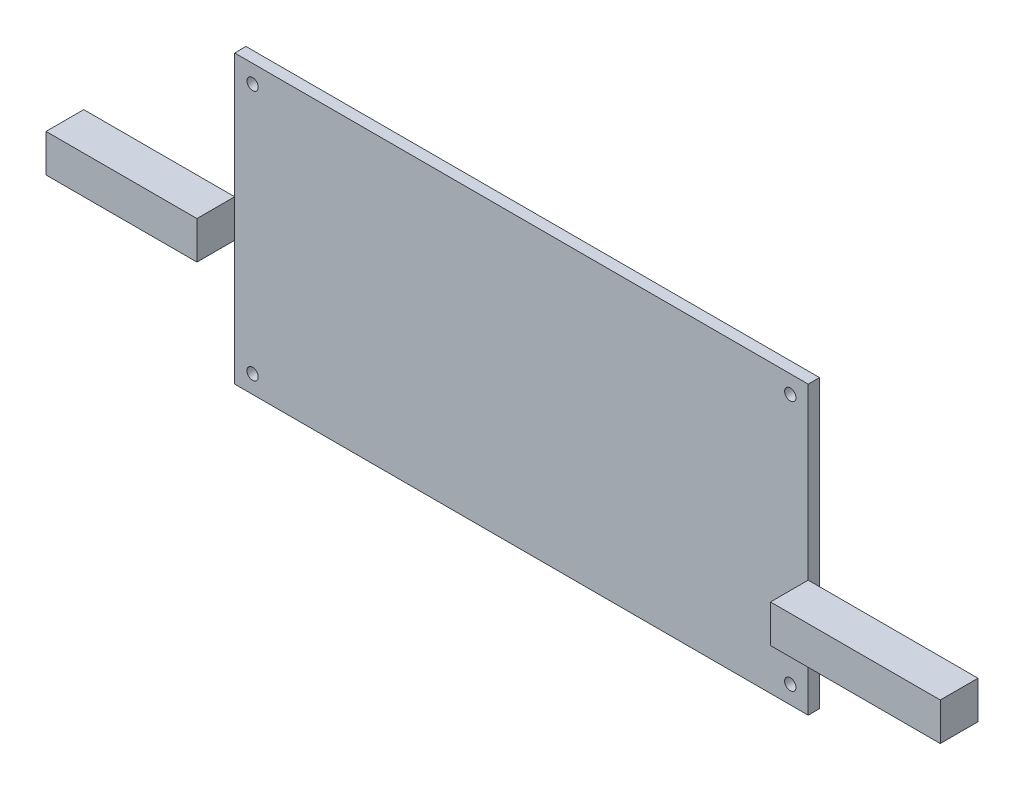
ISO-10303-21;
HEADER;
FILE_DESCRIPTION(('STEP AP214'),'2;1');
FILE_NAME('part.step','',(''),(''),'','','');
FILE_SCHEMA(('AUTOMOTIVE_DESIGN { 1 0 10303 214 1 1 1 1 }'));
ENDSEC;
DATA;
#1=APPLICATION_CONTEXT('core data for automotive mechanical design processes');
#2=APPLICATION_PROTOCOL_DEFINITION('international standard','automotive_design',2000,#1);
#3=PRODUCT_CONTEXT('',#1,'mechanical');
#4=PRODUCT('Part','Part','',(#3));
#5=PRODUCT_RELATED_PRODUCT_CATEGORY('part','',(#4));
#6=PRODUCT_DEFINITION_FORMATION('','',#4);
#7=PRODUCT_DEFINITION_CONTEXT('part definition',#1,'design');
#8=PRODUCT_DEFINITION('design','',#6,#7);
#9=PRODUCT_DEFINITION_SHAPE('','',#8);
#10=(LENGTH_UNIT() NAMED_UNIT(*) SI_UNIT(.MILLI.,.METRE.));
#11=(NAMED_UNIT(*) PLANE_ANGLE_UNIT() SI_UNIT($,.RADIAN.));
#12=(NAMED_UNIT(*) SI_UNIT($,.STERADIAN.) SOLID_ANGLE_UNIT());
#13=UNCERTAINTY_MEASURE_WITH_UNIT(LENGTH_MEASURE(1.E-05),#10,'distance_accuracy_value','');
#14=(GEOMETRIC_REPRESENTATION_CONTEXT(3) GLOBAL_UNCERTAINTY_ASSIGNED_CONTEXT((#13)) GLOBAL_UNIT_ASSIGNED_CONTEXT((#10,
#11,#12)) REPRESENTATION_CONTEXT('',''));
#15=CARTESIAN_POINT('',(0.,0.,0.));
#16=DIRECTION('',(0.,0.,1.));
#17=DIRECTION('',(1.,0.,0.));
#18=AXIS2_PLACEMENT_3D('',#15,#16,#17);
#19=CARTESIAN_POINT('',(76.,-7.,11.5));
#20=DIRECTION('',(1.,0.,0.));
#21=DIRECTION('',(0.,0.,-1.));
#22=AXIS2_PLACEMENT_3D('',#19,#20,#21);
#23=PLANE('',#22);
#24=DIRECTION('',(0.,-1.,0.));
#25=VECTOR('',#24,1.);
#26=CARTESIAN_POINT('',(76.,-7.,1.5));
#27=LINE('',#26,#25);
#28=CARTESIAN_POINT('',(76.,-7.,1.5));
#29=VERTEX_POINT('',#28);
#30=CARTESIAN_POINT('',(76.,-17.,1.5));
#31=VERTEX_POINT('',#30);
#32=EDGE_CURVE('E115',#29,#31,#27,.T.);
#33=ORIENTED_EDGE('',*,*,#32,.T.);
#34=DIRECTION('',(0.,0.,-1.));
#35=VECTOR('',#34,1.);
#36=CARTESIAN_POINT('',(76.,-17.,11.5));
#37=LINE('',#36,#35);
#38=CARTESIAN_POINT('',(76.,-17.,11.5));
#39=VERTEX_POINT('',#38);
#40=EDGE_CURVE('E12',#39,#31,#37,.T.);
#41=ORIENTED_EDGE('',*,*,#40,.F.);
#42=DIRECTION('',(0.,-1.,0.));
#43=VECTOR('',#42,1.);
#44=CARTESIAN_POINT('',(76.,-7.,11.5));
#45=LINE('',#44,#43);
#46=CARTESIAN_POINT('',(76.,-7.,11.5));
#47=VERTEX_POINT('',#46);
#48=EDGE_CURVE('E103',#47,#39,#45,.T.);
#49=ORIENTED_EDGE('',*,*,#48,.F.);
#50=DIRECTION('',(0.,0.,-1.));
#51=VECTOR('',#50,1.);
#52=CARTESIAN_POINT('',(76.,-7.,11.5));
#53=LINE('',#52,#51);
#54=EDGE_CURVE('E111',#47,#29,#53,.T.);
#55=ORIENTED_EDGE('',*,*,#54,.T.);
#56=EDGE_LOOP('',(#33,#41,#49,#55));
#57=FACE_BOUND('',#56,.T.);
#58=ADVANCED_FACE('F52',(#57),#23,.F.);
#59=CARTESIAN_POINT('',(76.,-17.,11.5));
#60=DIRECTION('',(0.,1.,0.));
#61=DIRECTION('',(-1.,0.,0.));
#62=AXIS2_PLACEMENT_3D('',#59,#60,#61);
#63=PLANE('',#62);
#64=DIRECTION('',(1.,0.,0.));
#65=VECTOR('',#64,1.);
#66=CARTESIAN_POINT('',(76.,-17.,1.5));
#67=LINE('',#66,#65);
#68=CARTESIAN_POINT('',(121.,-17.,1.5));
#69=VERTEX_POINT('',#68);
#70=EDGE_CURVE('E107',#31,#69,#67,.T.);
#71=ORIENTED_EDGE('',*,*,#70,.T.);
#72=DIRECTION('',(0.,0.,-1.));
#73=VECTOR('',#72,1.);
#74=CARTESIAN_POINT('',(121.,-17.,11.5));
#75=LINE('',#74,#73);
#76=CARTESIAN_POINT('',(121.,-17.,11.5));
#77=VERTEX_POINT('',#76);
#78=EDGE_CURVE('E60',#77,#69,#75,.T.);
#79=ORIENTED_EDGE('',*,*,#78,.F.);
#80=DIRECTION('',(1.,0.,0.));
#81=VECTOR('',#80,1.);
#82=CARTESIAN_POINT('',(76.,-17.,11.5));
#83=LINE('',#82,#81);
#84=EDGE_CURVE('E98',#39,#77,#83,.T.);
#85=ORIENTED_EDGE('',*,*,#84,.F.);
#86=ORIENTED_EDGE('',*,*,#40,.T.);
#87=EDGE_LOOP('',(#71,#79,#85,#86));
#88=FACE_BOUND('',#87,.T.);
#89=ADVANCED_FACE('F106',(#88),#63,.F.);
#90=CARTESIAN_POINT('',(121.,-7.,11.5));
#91=DIRECTION('',(-1.,0.,0.));
#92=DIRECTION('',(0.,0.,1.));
#93=AXIS2_PLACEMENT_3D('',#90,#91,#92);
#94=PLANE('',#93);
#95=DIRECTION('',(0.,1.,0.));
#96=VECTOR('',#95,1.);
#97=CARTESIAN_POINT('',(121.,-7.,1.5));
#98=LINE('',#97,#96);
#99=CARTESIAN_POINT('',(121.,-7.,1.5));
#100=VERTEX_POINT('',#99);
#101=EDGE_CURVE('E85',#69,#100,#98,.T.);
#102=ORIENTED_EDGE('',*,*,#101,.T.);
#103=DIRECTION('',(0.,0.,-1.));
#104=VECTOR('',#103,1.);
#105=CARTESIAN_POINT('',(121.,-7.,11.5));
#106=LINE('',#105,#104);
#107=CARTESIAN_POINT('',(121.,-7.,11.5));
#108=VERTEX_POINT('',#107);
#109=EDGE_CURVE('E108',#108,#100,#106,.T.);
#110=ORIENTED_EDGE('',*,*,#109,.F.);
#111=DIRECTION('',(0.,1.,0.));
#112=VECTOR('',#111,1.);
#113=CARTESIAN_POINT('',(121.,-7.,11.5));
#114=LINE('',#113,#112);
#115=EDGE_CURVE('E101',#77,#108,#114,.T.);
#116=ORIENTED_EDGE('',*,*,#115,.F.);
#117=ORIENTED_EDGE('',*,*,#78,.T.);
#118=EDGE_LOOP('',(#102,#110,#116,#117));
#119=FACE_BOUND('',#118,.T.);
#120=ADVANCED_FACE('F109',(#119),#94,.F.);
#121=CARTESIAN_POINT('',(76.,-7.,11.5));
#122=DIRECTION('',(0.,-1.,0.));
#123=DIRECTION('',(0.,0.,-1.));
#124=AXIS2_PLACEMENT_3D('',#121,#122,#123);
#125=PLANE('',#124);
#126=DIRECTION('',(-1.,0.,0.));
#127=VECTOR('',#126,1.);
#128=CARTESIAN_POINT('',(76.,-7.,1.5));
#129=LINE('',#128,#127);
#130=EDGE_CURVE('E91',#100,#29,#129,.T.);
#131=ORIENTED_EDGE('',*,*,#130,.T.);
#132=ORIENTED_EDGE('',*,*,#54,.F.);
#133=DIRECTION('',(-1.,0.,0.));
#134=VECTOR('',#133,1.);
#135=CARTESIAN_POINT('',(76.,-7.,11.5));
#136=LINE('',#135,#134);
#137=EDGE_CURVE('E68',#108,#47,#136,.T.);
#138=ORIENTED_EDGE('',*,*,#137,.F.);
#139=ORIENTED_EDGE('',*,*,#109,.T.);
#140=EDGE_LOOP('',(#131,#132,#138,#139));
#141=FACE_BOUND('',#140,.T.);
#142=ADVANCED_FACE('F122',(#141),#125,.F.);
#143=CARTESIAN_POINT('',(0.,0.,11.5));
#144=DIRECTION('',(0.,0.,1.));
#145=DIRECTION('',(1.,0.,0.));
#146=AXIS2_PLACEMENT_3D('',#143,#144,#145);
#147=PLANE('',#146);
#148=ORIENTED_EDGE('',*,*,#48,.T.);
#149=ORIENTED_EDGE('',*,*,#84,.T.);
#150=ORIENTED_EDGE('',*,*,#115,.T.);
#151=ORIENTED_EDGE('',*,*,#137,.T.);
#152=EDGE_LOOP('',(#148,#149,#150,#151));
#153=FACE_BOUND('',#152,.T.);
#154=ADVANCED_FACE('F99',(#153),#147,.T.);
#155=CARTESIAN_POINT('',(0.,0.,1.5));
#156=DIRECTION('',(0.,0.,1.));
#157=DIRECTION('',(1.,0.,0.));
#158=AXIS2_PLACEMENT_3D('',#155,#156,#157);
#159=PLANE('',#158);
#160=ORIENTED_EDGE('',*,*,#32,.F.);
#161=ORIENTED_EDGE('',*,*,#130,.F.);
#162=ORIENTED_EDGE('',*,*,#101,.F.);
#163=ORIENTED_EDGE('',*,*,#70,.F.);
#164=EDGE_LOOP('',(#160,#161,#162,#163));
#165=FACE_BOUND('',#164,.T.);
#166=ADVANCED_FACE('F125',(#165),#159,.F.);
#167=CLOSED_SHELL('',(#58,#89,#120,#142,#154,#166));
#168=MANIFOLD_SOLID_BREP('B2',#167);
#169=CARTESIAN_POINT('',(-76.,5.,11.5));
#170=DIRECTION('',(-1.,0.,0.));
#171=DIRECTION('',(0.,0.,1.));
#172=AXIS2_PLACEMENT_3D('',#169,#170,#171);
#173=PLANE('',#172);
#174=DIRECTION('',(0.,1.,0.));
#175=VECTOR('',#174,1.);
#176=CARTESIAN_POINT('',(-76.,5.,1.5));
#177=LINE('',#176,#175);
#178=CARTESIAN_POINT('',(-76.,-5.,1.5));
#179=VERTEX_POINT('',#178);
#180=CARTESIAN_POINT('',(-76.,5.,1.5));
#181=VERTEX_POINT('',#180);
#182=EDGE_CURVE('E250',#179,#181,#177,.T.);
#183=ORIENTED_EDGE('',*,*,#182,.T.);
#184=DIRECTION('',(0.,0.,-1.));
#185=VECTOR('',#184,1.);
#186=CARTESIAN_POINT('',(-76.,5.,11.5));
#187=LINE('',#186,#185);
#188=CARTESIAN_POINT('',(-76.,5.,11.5));
#189=VERTEX_POINT('',#188);
#190=EDGE_CURVE('E50',#189,#181,#187,.T.);
#191=ORIENTED_EDGE('',*,*,#190,.F.);
#192=DIRECTION('',(0.,1.,0.));
#193=VECTOR('',#192,1.);
#194=CARTESIAN_POINT('',(-76.,5.,11.5));
#195=LINE('',#194,#193);
#196=CARTESIAN_POINT('',(-76.,-5.,11.5));
#197=VERTEX_POINT('',#196);
#198=EDGE_CURVE('E238',#197,#189,#195,.T.);
#199=ORIENTED_EDGE('',*,*,#198,.F.);
#200=DIRECTION('',(0.,0.,-1.));
#201=VECTOR('',#200,1.);
#202=CARTESIAN_POINT('',(-76.,-5.,11.5));
#203=LINE('',#202,#201);
#204=EDGE_CURVE('E246',#197,#179,#203,.T.);
#205=ORIENTED_EDGE('',*,*,#204,.T.);
#206=EDGE_LOOP('',(#183,#191,#199,#205));
#207=FACE_BOUND('',#206,.T.);
#208=ADVANCED_FACE('F187',(#207),#173,.F.);
#209=CARTESIAN_POINT('',(-76.,5.,11.5));
#210=DIRECTION('',(0.,-1.,0.));
#211=DIRECTION('',(1.,0.,0.));
#212=AXIS2_PLACEMENT_3D('',#209,#210,#211);
#213=PLANE('',#212);
#214=DIRECTION('',(-1.,0.,0.));
#215=VECTOR('',#214,1.);
#216=CARTESIAN_POINT('',(-76.,5.,1.5));
#217=LINE('',#216,#215);
#218=CARTESIAN_POINT('',(-116.,5.,1.5));
#219=VERTEX_POINT('',#218);
#220=EDGE_CURVE('E242',#181,#219,#217,.T.);
#221=ORIENTED_EDGE('',*,*,#220,.T.);
#222=DIRECTION('',(0.,0.,-1.));
#223=VECTOR('',#222,1.);
#224=CARTESIAN_POINT('',(-116.,5.,11.5));
#225=LINE('',#224,#223);
#226=CARTESIAN_POINT('',(-116.,5.,11.5));
#227=VERTEX_POINT('',#226);
#228=EDGE_CURVE('E195',#227,#219,#225,.T.);
#229=ORIENTED_EDGE('',*,*,#228,.F.);
#230=DIRECTION('',(-1.,0.,0.));
#231=VECTOR('',#230,1.);
#232=CARTESIAN_POINT('',(-76.,5.,11.5));
#233=LINE('',#232,#231);
#234=EDGE_CURVE('E233',#189,#227,#233,.T.);
#235=ORIENTED_EDGE('',*,*,#234,.F.);
#236=ORIENTED_EDGE('',*,*,#190,.T.);
#237=EDGE_LOOP('',(#221,#229,#235,#236));
#238=FACE_BOUND('',#237,.T.);
#239=ADVANCED_FACE('F241',(#238),#213,.F.);
#240=CARTESIAN_POINT('',(-116.,5.,11.5));
#241=DIRECTION('',(1.,0.,0.));
#242=DIRECTION('',(0.,0.,-1.));
#243=AXIS2_PLACEMENT_3D('',#240,#241,#242);
#244=PLANE('',#243);
#245=DIRECTION('',(0.,-1.,0.));
#246=VECTOR('',#245,1.);
#247=CARTESIAN_POINT('',(-116.,5.,1.5));
#248=LINE('',#247,#246);
#249=CARTESIAN_POINT('',(-116.,-5.,1.5));
#250=VERTEX_POINT('',#249);
#251=EDGE_CURVE('E220',#219,#250,#248,.T.);
#252=ORIENTED_EDGE('',*,*,#251,.T.);
#253=DIRECTION('',(0.,0.,-1.));
#254=VECTOR('',#253,1.);
#255=CARTESIAN_POINT('',(-116.,-5.,11.5));
#256=LINE('',#255,#254);
#257=CARTESIAN_POINT('',(-116.,-5.,11.5));
#258=VERTEX_POINT('',#257);
#259=EDGE_CURVE('E243',#258,#250,#256,.T.);
#260=ORIENTED_EDGE('',*,*,#259,.F.);
#261=DIRECTION('',(0.,-1.,0.));
#262=VECTOR('',#261,1.);
#263=CARTESIAN_POINT('',(-116.,5.,11.5));
#264=LINE('',#263,#262);
#265=EDGE_CURVE('E236',#227,#258,#264,.T.);
#266=ORIENTED_EDGE('',*,*,#265,.F.);
#267=ORIENTED_EDGE('',*,*,#228,.T.);
#268=EDGE_LOOP('',(#252,#260,#266,#267));
#269=FACE_BOUND('',#268,.T.);
#270=ADVANCED_FACE('F244',(#269),#244,.F.);
#271=CARTESIAN_POINT('',(-76.,-5.,11.5));
#272=DIRECTION('',(0.,1.,0.));
#273=DIRECTION('',(-1.,0.,0.));
#274=AXIS2_PLACEMENT_3D('',#271,#272,#273);
#275=PLANE('',#274);
#276=DIRECTION('',(1.,0.,0.));
#277=VECTOR('',#276,1.);
#278=CARTESIAN_POINT('',(-76.,-5.,1.5));
#279=LINE('',#278,#277);
#280=EDGE_CURVE('E226',#250,#179,#279,.T.);
#281=ORIENTED_EDGE('',*,*,#280,.T.);
#282=ORIENTED_EDGE('',*,*,#204,.F.);
#283=DIRECTION('',(1.,0.,0.));
#284=VECTOR('',#283,1.);
#285=CARTESIAN_POINT('',(-76.,-5.,11.5));
#286=LINE('',#285,#284);
#287=EDGE_CURVE('E203',#258,#197,#286,.T.);
#288=ORIENTED_EDGE('',*,*,#287,.F.);
#289=ORIENTED_EDGE('',*,*,#259,.T.);
#290=EDGE_LOOP('',(#281,#282,#288,#289));
#291=FACE_BOUND('',#290,.T.);
#292=ADVANCED_FACE('F257',(#291),#275,.F.);
#293=CARTESIAN_POINT('',(0.,0.,11.5));
#294=DIRECTION('',(0.,0.,-1.));
#295=DIRECTION('',(-1.,0.,0.));
#296=AXIS2_PLACEMENT_3D('',#293,#294,#295);
#297=PLANE('',#296);
#298=ORIENTED_EDGE('',*,*,#198,.T.);
#299=ORIENTED_EDGE('',*,*,#234,.T.);
#300=ORIENTED_EDGE('',*,*,#265,.T.);
#301=ORIENTED_EDGE('',*,*,#287,.T.);
#302=EDGE_LOOP('',(#298,#299,#300,#301));
#303=FACE_BOUND('',#302,.T.);
#304=ADVANCED_FACE('F234',(#303),#297,.F.);
#305=CARTESIAN_POINT('',(0.,0.,1.5));
#306=DIRECTION('',(0.,0.,-1.));
#307=DIRECTION('',(-1.,0.,0.));
#308=AXIS2_PLACEMENT_3D('',#305,#306,#307);
#309=PLANE('',#308);
#310=ORIENTED_EDGE('',*,*,#182,.F.);
#311=ORIENTED_EDGE('',*,*,#280,.F.);
#312=ORIENTED_EDGE('',*,*,#251,.F.);
#313=ORIENTED_EDGE('',*,*,#220,.F.);
#314=EDGE_LOOP('',(#310,#311,#312,#313));
#315=FACE_BOUND('',#314,.T.);
#316=ADVANCED_FACE('F260',(#315),#309,.T.);
#317=CLOSED_SHELL('',(#208,#239,#270,#292,#304,#316));
#318=MANIFOLD_SOLID_BREP('B6',#317);
#319=CARTESIAN_POINT('',(76.,-38.,1.5));
#320=DIRECTION('',(-1.,0.,0.));
#321=DIRECTION('',(0.,0.,1.));
#322=AXIS2_PLACEMENT_3D('',#319,#320,#321);
#323=PLANE('',#322);
#324=DIRECTION('',(0.,1.,0.));
#325=VECTOR('',#324,1.);
#326=CARTESIAN_POINT('',(76.,-38.,-1.5));
#327=LINE('',#326,#325);
#328=CARTESIAN_POINT('',(76.,-38.,-1.5));
#329=VERTEX_POINT('',#328);
#330=CARTESIAN_POINT('',(76.,38.,-1.5));
#331=VERTEX_POINT('',#330);
#332=EDGE_CURVE('E379',#329,#331,#327,.T.);
#333=ORIENTED_EDGE('',*,*,#332,.T.);
#334=DIRECTION('',(0.,0.,-1.));
#335=VECTOR('',#334,1.);
#336=CARTESIAN_POINT('',(76.,38.,1.5));
#337=LINE('',#336,#335);
#338=CARTESIAN_POINT('',(76.,38.,1.5));
#339=VERTEX_POINT('',#338);
#340=EDGE_CURVE('E185',#339,#331,#337,.T.);
#341=ORIENTED_EDGE('',*,*,#340,.F.);
#342=DIRECTION('',(0.,1.,0.));
#343=VECTOR('',#342,1.);
#344=CARTESIAN_POINT('',(76.,-38.,1.5));
#345=LINE('',#344,#343);
#346=CARTESIAN_POINT('',(76.,-38.,1.5));
#347=VERTEX_POINT('',#346);
#348=EDGE_CURVE('E367',#347,#339,#345,.T.);
#349=ORIENTED_EDGE('',*,*,#348,.F.);
#350=DIRECTION('',(0.,0.,-1.));
#351=VECTOR('',#350,1.);
#352=CARTESIAN_POINT('',(76.,-38.,1.5));
#353=LINE('',#352,#351);
#354=EDGE_CURVE('E375',#347,#329,#353,.T.);
#355=ORIENTED_EDGE('',*,*,#354,.T.);
#356=EDGE_LOOP('',(#333,#341,#349,#355));
#357=FACE_BOUND('',#356,.T.);
#358=ADVANCED_FACE('F316',(#357),#323,.F.);
#359=CARTESIAN_POINT('',(-76.,38.,1.5));
#360=DIRECTION('',(0.,-1.,0.));
#361=DIRECTION('',(0.,0.,-1.));
#362=AXIS2_PLACEMENT_3D('',#359,#360,#361);
#363=PLANE('',#362);
#364=DIRECTION('',(-1.,0.,0.));
#365=VECTOR('',#364,1.);
#366=CARTESIAN_POINT('',(-76.,38.,-1.5));
#367=LINE('',#366,#365);
#368=CARTESIAN_POINT('',(-76.,38.,-1.5));
#369=VERTEX_POINT('',#368);
#370=EDGE_CURVE('E371',#331,#369,#367,.T.);
#371=ORIENTED_EDGE('',*,*,#370,.T.);
#372=DIRECTION('',(0.,0.,-1.));
#373=VECTOR('',#372,1.);
#374=CARTESIAN_POINT('',(-76.,38.,1.5));
#375=LINE('',#374,#373);
#376=CARTESIAN_POINT('',(-76.,38.,1.5));
#377=VERTEX_POINT('',#376);
#378=EDGE_CURVE('E324',#377,#369,#375,.T.);
#379=ORIENTED_EDGE('',*,*,#378,.F.);
#380=DIRECTION('',(-1.,0.,0.));
#381=VECTOR('',#380,1.);
#382=CARTESIAN_POINT('',(-76.,38.,1.5));
#383=LINE('',#382,#381);
#384=EDGE_CURVE('E362',#339,#377,#383,.T.);
#385=ORIENTED_EDGE('',*,*,#384,.F.);
#386=ORIENTED_EDGE('',*,*,#340,.T.);
#387=EDGE_LOOP('',(#371,#379,#385,#386));
#388=FACE_BOUND('',#387,.T.);
#389=ADVANCED_FACE('F370',(#388),#363,.F.);
#390=CARTESIAN_POINT('',(-76.,-38.,1.5));
#391=DIRECTION('',(1.,0.,0.));
#392=DIRECTION('',(0.,0.,-1.));
#393=AXIS2_PLACEMENT_3D('',#390,#391,#392);
#394=PLANE('',#393);
#395=DIRECTION('',(0.,-1.,0.));
#396=VECTOR('',#395,1.);
#397=CARTESIAN_POINT('',(-76.,-38.,-1.5));
#398=LINE('',#397,#396);
#399=CARTESIAN_POINT('',(-76.,-38.,-1.5));
#400=VERTEX_POINT('',#399);
#401=EDGE_CURVE('E349',#369,#400,#398,.T.);
#402=ORIENTED_EDGE('',*,*,#401,.T.);
#403=DIRECTION('',(0.,0.,-1.));
#404=VECTOR('',#403,1.);
#405=CARTESIAN_POINT('',(-76.,-38.,1.5));
#406=LINE('',#405,#404);
#407=CARTESIAN_POINT('',(-76.,-38.,1.5));
#408=VERTEX_POINT('',#407);
#409=EDGE_CURVE('E372',#408,#400,#406,.T.);
#410=ORIENTED_EDGE('',*,*,#409,.F.);
#411=DIRECTION('',(0.,-1.,0.));
#412=VECTOR('',#411,1.);
#413=CARTESIAN_POINT('',(-76.,-38.,1.5));
#414=LINE('',#413,#412);
#415=EDGE_CURVE('E365',#377,#408,#414,.T.);
#416=ORIENTED_EDGE('',*,*,#415,.F.);
#417=ORIENTED_EDGE('',*,*,#378,.T.);
#418=EDGE_LOOP('',(#402,#410,#416,#417));
#419=FACE_BOUND('',#418,.T.);
#420=ADVANCED_FACE('F373',(#419),#394,.F.);
#421=CARTESIAN_POINT('',(-76.,-38.,1.5));
#422=DIRECTION('',(0.,1.,0.));
#423=DIRECTION('',(0.,0.,1.));
#424=AXIS2_PLACEMENT_3D('',#421,#422,#423);
#425=PLANE('',#424);
#426=DIRECTION('',(1.,0.,0.));
#427=VECTOR('',#426,1.);
#428=CARTESIAN_POINT('',(-76.,-38.,-1.5));
#429=LINE('',#428,#427);
#430=EDGE_CURVE('E355',#400,#329,#429,.T.);
#431=ORIENTED_EDGE('',*,*,#430,.T.);
#432=ORIENTED_EDGE('',*,*,#354,.F.);
#433=DIRECTION('',(1.,0.,0.));
#434=VECTOR('',#433,1.);
#435=CARTESIAN_POINT('',(-76.,-38.,1.5));
#436=LINE('',#435,#434);
#437=EDGE_CURVE('E332',#408,#347,#436,.T.);
#438=ORIENTED_EDGE('',*,*,#437,.F.);
#439=ORIENTED_EDGE('',*,*,#409,.T.);
#440=EDGE_LOOP('',(#431,#432,#438,#439));
#441=FACE_BOUND('',#440,.T.);
#442=ADVANCED_FACE('F387',(#441),#425,.F.);
#443=CARTESIAN_POINT('',(0.,0.,1.5));
#444=DIRECTION('',(0.,0.,-1.));
#445=DIRECTION('',(-1.,0.,0.));
#446=AXIS2_PLACEMENT_3D('',#443,#444,#445);
#447=PLANE('',#446);
#448=CARTESIAN_POINT('',(71.25,-33.25,1.5));
#449=DIRECTION('',(0.,0.,1.));
#450=DIRECTION('',(1.,0.,0.));
#451=AXIS2_PLACEMENT_3D('',#448,#449,#450);
#452=CIRCLE('',#451,1.5);
#453=CARTESIAN_POINT('',(72.7500000000001,-33.25,1.5));
#454=VERTEX_POINT('',#453);
#455=EDGE_CURVE('E403',#454,#454,#452,.T.);
#456=ORIENTED_EDGE('',*,*,#455,.F.);
#457=EDGE_LOOP('',(#456));
#458=FACE_BOUND('',#457,.T.);
#459=CARTESIAN_POINT('',(-71.2499999999999,33.25,1.5));
#460=DIRECTION('',(0.,0.,1.));
#461=DIRECTION('',(1.,0.,0.));
#462=AXIS2_PLACEMENT_3D('',#459,#460,#461);
#463=CIRCLE('',#462,1.5);
#464=CARTESIAN_POINT('',(-69.7499999999999,33.25,1.5));
#465=VERTEX_POINT('',#464);
#466=EDGE_CURVE('E402',#465,#465,#463,.T.);
#467=ORIENTED_EDGE('',*,*,#466,.F.);
#468=EDGE_LOOP('',(#467));
#469=FACE_BOUND('',#468,.T.);
#470=CARTESIAN_POINT('',(-71.2499999999999,-33.25,1.5));
#471=DIRECTION('',(0.,0.,1.));
#472=DIRECTION('',(1.,0.,0.));
#473=AXIS2_PLACEMENT_3D('',#470,#471,#472);
#474=CIRCLE('',#473,1.5);
#475=CARTESIAN_POINT('',(-69.7499999999999,-33.25,1.5));
#476=VERTEX_POINT('',#475);
#477=EDGE_CURVE('E409',#476,#476,#474,.T.);
#478=ORIENTED_EDGE('',*,*,#477,.F.);
#479=EDGE_LOOP('',(#478));
#480=FACE_BOUND('',#479,.T.);
#481=CARTESIAN_POINT('',(71.25,33.25,1.5));
#482=DIRECTION('',(0.,0.,1.));
#483=DIRECTION('',(1.,0.,0.));
#484=AXIS2_PLACEMENT_3D('',#481,#482,#483);
#485=CIRCLE('',#484,1.5);
#486=CARTESIAN_POINT('',(72.7500000000001,33.25,1.5));
#487=VERTEX_POINT('',#486);
#488=EDGE_CURVE('E395',#487,#487,#485,.T.);
#489=ORIENTED_EDGE('',*,*,#488,.F.);
#490=EDGE_LOOP('',(#489));
#491=FACE_BOUND('',#490,.T.);
#492=ORIENTED_EDGE('',*,*,#348,.T.);
#493=ORIENTED_EDGE('',*,*,#384,.T.);
#494=ORIENTED_EDGE('',*,*,#415,.T.);
#495=ORIENTED_EDGE('',*,*,#437,.T.);
#496=EDGE_LOOP('',(#492,#493,#494,#495));
#497=FACE_BOUND('',#496,.T.);
#498=ADVANCED_FACE('F363',(#458,#469,#480,#491,#497),#447,.F.);
#499=CARTESIAN_POINT('',(0.,0.,-1.5));
#500=DIRECTION('',(0.,0.,-1.));
#501=DIRECTION('',(-1.,0.,0.));
#502=AXIS2_PLACEMENT_3D('',#499,#500,#501);
#503=PLANE('',#502);
#504=CARTESIAN_POINT('',(71.25,-33.25,-1.5));
#505=DIRECTION('',(0.,0.,1.));
#506=DIRECTION('',(1.,0.,0.));
#507=AXIS2_PLACEMENT_3D('',#504,#505,#506);
#508=CIRCLE('',#507,1.5);
#509=CARTESIAN_POINT('',(72.7500000000001,-33.25,-1.5));
#510=VERTEX_POINT('',#509);
#511=EDGE_CURVE('E399',#510,#510,#508,.T.);
#512=ORIENTED_EDGE('',*,*,#511,.T.);
#513=EDGE_LOOP('',(#512));
#514=FACE_BOUND('',#513,.T.);
#515=CARTESIAN_POINT('',(-71.2499999999999,33.25,-1.5));
#516=DIRECTION('',(0.,0.,1.));
#517=DIRECTION('',(1.,0.,0.));
#518=AXIS2_PLACEMENT_3D('',#515,#516,#517);
#519=CIRCLE('',#518,1.5);
#520=CARTESIAN_POINT('',(-69.7499999999999,33.25,-1.5));
#521=VERTEX_POINT('',#520);
#522=EDGE_CURVE('E406',#521,#521,#519,.T.);
#523=ORIENTED_EDGE('',*,*,#522,.T.);
#524=EDGE_LOOP('',(#523));
#525=FACE_BOUND('',#524,.T.);
#526=CARTESIAN_POINT('',(-71.2499999999999,-33.25,-1.5));
#527=DIRECTION('',(0.,0.,1.));
#528=DIRECTION('',(1.,0.,0.));
#529=AXIS2_PLACEMENT_3D('',#526,#527,#528);
#530=CIRCLE('',#529,1.5);
#531=CARTESIAN_POINT('',(-69.7499999999999,-33.25,-1.5));
#532=VERTEX_POINT('',#531);
#533=EDGE_CURVE('E398',#532,#532,#530,.T.);
#534=ORIENTED_EDGE('',*,*,#533,.T.);
#535=EDGE_LOOP('',(#534));
#536=FACE_BOUND('',#535,.T.);
#537=CARTESIAN_POINT('',(71.25,33.25,-1.5));
#538=DIRECTION('',(0.,0.,1.));
#539=DIRECTION('',(1.,0.,0.));
#540=AXIS2_PLACEMENT_3D('',#537,#538,#539);
#541=CIRCLE('',#540,1.5);
#542=CARTESIAN_POINT('',(72.7500000000001,33.25,-1.5));
#543=VERTEX_POINT('',#542);
#544=EDGE_CURVE('E382',#543,#543,#541,.T.);
#545=ORIENTED_EDGE('',*,*,#544,.T.);
#546=EDGE_LOOP('',(#545));
#547=FACE_BOUND('',#546,.T.);
#548=ORIENTED_EDGE('',*,*,#332,.F.);
#549=ORIENTED_EDGE('',*,*,#430,.F.);
#550=ORIENTED_EDGE('',*,*,#401,.F.);
#551=ORIENTED_EDGE('',*,*,#370,.F.);
#552=EDGE_LOOP('',(#548,#549,#550,#551));
#553=FACE_BOUND('',#552,.T.);
#554=ADVANCED_FACE('F390',(#514,#525,#536,#547,#553),#503,.T.);
#555=CARTESIAN_POINT('',(71.25,33.25,-1.5));
#556=DIRECTION('',(0.,0.,1.));
#557=DIRECTION('',(1.,0.,0.));
#558=AXIS2_PLACEMENT_3D('',#555,#556,#557);
#559=CYLINDRICAL_SURFACE('',#558,1.5);
#560=ORIENTED_EDGE('',*,*,#544,.F.);
#561=EDGE_LOOP('',(#560));
#562=FACE_BOUND('',#561,.T.);
#563=ORIENTED_EDGE('',*,*,#488,.T.);
#564=EDGE_LOOP('',(#563));
#565=FACE_BOUND('',#564,.T.);
#566=ADVANCED_FACE('F425',(#562,#565),#559,.F.);
#567=CARTESIAN_POINT('',(-71.2499999999999,-33.25,-1.5));
#568=DIRECTION('',(0.,0.,1.));
#569=DIRECTION('',(1.,0.,0.));
#570=AXIS2_PLACEMENT_3D('',#567,#568,#569);
#571=CYLINDRICAL_SURFACE('',#570,1.5);
#572=ORIENTED_EDGE('',*,*,#533,.F.);
#573=EDGE_LOOP('',(#572));
#574=FACE_BOUND('',#573,.T.);
#575=ORIENTED_EDGE('',*,*,#477,.T.);
#576=EDGE_LOOP('',(#575));
#577=FACE_BOUND('',#576,.T.);
#578=ADVANCED_FACE('F417',(#574,#577),#571,.F.);
#579=CARTESIAN_POINT('',(-71.2499999999999,33.25,-1.5));
#580=DIRECTION('',(0.,0.,1.));
#581=DIRECTION('',(1.,0.,0.));
#582=AXIS2_PLACEMENT_3D('',#579,#580,#581);
#583=CYLINDRICAL_SURFACE('',#582,1.5);
#584=ORIENTED_EDGE('',*,*,#522,.F.);
#585=EDGE_LOOP('',(#584));
#586=FACE_BOUND('',#585,.T.);
#587=ORIENTED_EDGE('',*,*,#466,.T.);
#588=EDGE_LOOP('',(#587));
#589=FACE_BOUND('',#588,.T.);
#590=ADVANCED_FACE('F433',(#586,#589),#583,.F.);
#591=CARTESIAN_POINT('',(71.25,-33.25,-1.5));
#592=DIRECTION('',(0.,0.,1.));
#593=DIRECTION('',(1.,0.,0.));
#594=AXIS2_PLACEMENT_3D('',#591,#592,#593);
#595=CYLINDRICAL_SURFACE('',#594,1.5);
#596=ORIENTED_EDGE('',*,*,#511,.F.);
#597=EDGE_LOOP('',(#596));
#598=FACE_BOUND('',#597,.T.);
#599=ORIENTED_EDGE('',*,*,#455,.T.);
#600=EDGE_LOOP('',(#599));
#601=FACE_BOUND('',#600,.T.);
#602=ADVANCED_FACE('F483',(#598,#601),#595,.F.);
#603=CLOSED_SHELL('',(#358,#389,#420,#442,#498,#554,#566,#578,#590,#602));
#604=MANIFOLD_SOLID_BREP('B44',#603);
#605=ADVANCED_BREP_SHAPE_REPRESENTATION('',(#18,#168,#318,#604),#14);
#606=SHAPE_DEFINITION_REPRESENTATION(#9,#605);
ENDSEC;
END-ISO-10303-21;
